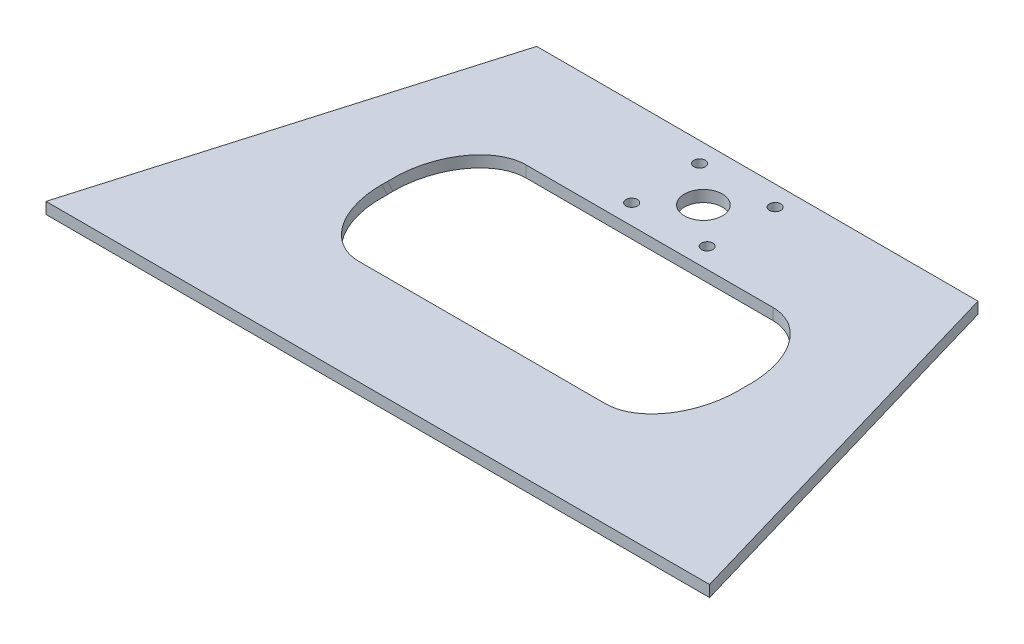
ISO-10303-21;
HEADER;
FILE_DESCRIPTION(('STEP AP214'),'2;1');
FILE_NAME('part.step','',(''),(''),'','','');
FILE_SCHEMA(('AUTOMOTIVE_DESIGN { 1 0 10303 214 1 1 1 1 }'));
ENDSEC;
DATA;
#1=APPLICATION_CONTEXT('core data for automotive mechanical design processes');
#2=APPLICATION_PROTOCOL_DEFINITION('international standard','automotive_design',2000,#1);
#3=PRODUCT_CONTEXT('',#1,'mechanical');
#4=PRODUCT('Part','Part','',(#3));
#5=PRODUCT_RELATED_PRODUCT_CATEGORY('part','',(#4));
#6=PRODUCT_DEFINITION_FORMATION('','',#4);
#7=PRODUCT_DEFINITION_CONTEXT('part definition',#1,'design');
#8=PRODUCT_DEFINITION('design','',#6,#7);
#9=PRODUCT_DEFINITION_SHAPE('','',#8);
#10=(LENGTH_UNIT() NAMED_UNIT(*) SI_UNIT(.MILLI.,.METRE.));
#11=(NAMED_UNIT(*) PLANE_ANGLE_UNIT() SI_UNIT($,.RADIAN.));
#12=(NAMED_UNIT(*) SI_UNIT($,.STERADIAN.) SOLID_ANGLE_UNIT());
#13=UNCERTAINTY_MEASURE_WITH_UNIT(LENGTH_MEASURE(1.E-05),#10,'distance_accuracy_value','');
#14=(GEOMETRIC_REPRESENTATION_CONTEXT(3) GLOBAL_UNCERTAINTY_ASSIGNED_CONTEXT((#13)) GLOBAL_UNIT_ASSIGNED_CONTEXT((#10,
#11,#12)) REPRESENTATION_CONTEXT('',''));
#15=CARTESIAN_POINT('',(0.,0.,0.));
#16=DIRECTION('',(0.,0.,1.));
#17=DIRECTION('',(1.,0.,0.));
#18=AXIS2_PLACEMENT_3D('',#15,#16,#17);
#19=CARTESIAN_POINT('',(54.8999999999994,-7.,-48.0395752908427));
#20=DIRECTION('',(0.,1.,0.));
#21=DIRECTION('',(0.,0.,1.));
#22=AXIS2_PLACEMENT_3D('',#19,#20,#21);
#23=ELLIPSE('',#22,20.5155954288015,14.5);
#24=DIRECTION('',(0.,1.,0.));
#25=VECTOR('',#24,1.);
#26=SURFACE_OF_LINEAR_EXTRUSION('',#23,#25);
#27=DIRECTION('',(0.,1.,0.));
#28=VECTOR('',#27,1.);
#29=CARTESIAN_POINT('',(54.8999999999994,1.5,-27.5239798620412));
#30=LINE('',#29,#28);
#31=CARTESIAN_POINT('',(54.8999999999994,0.,-27.5239798620412));
#32=VERTEX_POINT('',#31);
#33=CARTESIAN_POINT('',(54.8999999999994,3.,-27.5239798620412));
#34=VERTEX_POINT('',#33);
#35=EDGE_CURVE('E50',#32,#34,#30,.T.);
#36=ORIENTED_EDGE('',*,*,#35,.F.);
#37=CARTESIAN_POINT('',(54.8999999999994,0.,-48.0395752908427));
#38=DIRECTION('',(0.,1.,0.));
#39=DIRECTION('',(0.,0.,1.));
#40=AXIS2_PLACEMENT_3D('',#37,#38,#39);
#41=ELLIPSE('',#40,20.5155954288015,14.5);
#42=CARTESIAN_POINT('',(40.4388811468374,0.,-49.5409646205544));
#43=VERTEX_POINT('',#42);
#44=EDGE_CURVE('E155',#32,#43,#41,.F.);
#45=ORIENTED_EDGE('',*,*,#44,.T.);
#46=CARTESIAN_POINT('',(40.8380503622644,-7.,-53.0442063898716));
#47=CARTESIAN_POINT('',(40.764359717433,-6.17134305892181,-52.6294941618387));
#48=CARTESIAN_POINT('',(40.7002759410238,-5.34201217488286,-52.2144446477376));
#49=CARTESIAN_POINT('',(40.5908220425168,-3.6823369601079,-51.3838384260593));
#50=CARTESIAN_POINT('',(40.5454524806224,-2.85199259977995,-50.9682817036725));
#51=CARTESIAN_POINT('',(40.4729588721765,-1.19130659468812,-50.1371696213149));
#52=CARTESIAN_POINT('',(40.4458209683537,-0.360965428637962,-49.7216145009201));
#53=CARTESIAN_POINT('',(40.4094839537083,1.30000680492889,-48.8903591726677));
#54=CARTESIAN_POINT('',(40.4002840885266,2.1306378587854,-48.4746589716466));
#55=CARTESIAN_POINT('',(40.4000021612994,2.97416633493186,-48.0525040872018));
#56=CARTESIAN_POINT('',(40.4000000018857,2.98708317015572,-48.046039687676));
#57=CARTESIAN_POINT('',(40.3999999999994,2.99999999999998,-48.0395752908427));
#58=B_SPLINE_CURVE_WITH_KNOTS('',3,(#46,#47,#48,#49,#50,#51,#52,#53,#54,#55,#56,#57),
.UNSPECIFIED.,.F.,.F.,(4,2,2,2,2,4),(0.,2.78862709260098,5.57733765571683,8.36392620822776,
11.1503975721296,11.1937299828238),.UNSPECIFIED.);
#59=CARTESIAN_POINT('',(40.3999999999994,3.,-48.0395752908427));
#60=VERTEX_POINT('',#59);
#61=EDGE_CURVE('E146',#43,#60,#58,.T.);
#62=ORIENTED_EDGE('',*,*,#61,.T.);
#63=CARTESIAN_POINT('',(54.8999999999994,2.99999999999998,-48.0395752908427));
#64=DIRECTION('',(0.,-1.,0.));
#65=DIRECTION('',(0.,0.,1.));
#66=AXIS2_PLACEMENT_3D('',#63,#64,#65);
#67=ELLIPSE('',#66,20.5155954288015,14.5);
#68=EDGE_CURVE('E168',#34,#60,#67,.T.);
#69=ORIENTED_EDGE('',*,*,#68,.F.);
#70=EDGE_LOOP('',(#36,#45,#62,#69));
#71=FACE_BOUND('',#70,.T.);
#72=ADVANCED_FACE('F42',(#71),#26,.F.);
#73=CARTESIAN_POINT('',(119.9,-40.2845577931788,-91.3642240987341));
#74=DIRECTION('',(0.,0.706779388895714,0.707434021964028));
#75=DIRECTION('',(-1.,0.,0.));
#76=AXIS2_PLACEMENT_3D('',#73,#74,#75);
#77=CYLINDRICAL_SURFACE('',#76,14.5);
#78=CARTESIAN_POINT('',(134.327032886282,4.10732985603376,-48.9867868771124));
#79=CARTESIAN_POINT('',(134.367642751696,2.96618665467746,-49.5578869547174));
#80=CARTESIAN_POINT('',(134.391257266257,1.82462857676761,-50.1291946586805));
#81=CARTESIAN_POINT('',(134.399253217156,0.468254060296802,-50.8080100669501));
#82=CARTESIAN_POINT('',(134.399921728441,0.25350231158661,-50.9154853949498));
#83=CARTESIAN_POINT('',(134.39999783978,0.0258336700292439,-51.0294251514074));
#84=CARTESIAN_POINT('',(134.399999999198,0.0129168348674314,-51.0358895509072));
#85=CARTESIAN_POINT('',(134.4,0.,-51.0423539502601));
#86=B_SPLINE_CURVE_WITH_KNOTS('',3,(#78,#79,#80,#81,#82,#83,#84,#85),.UNSPECIFIED.,.F.,.F.,(4,2,
2,4),(0.,3.8298801230995,4.55031307091073,4.59364548160489),.UNSPECIFIED.);
#87=CARTESIAN_POINT('',(134.4,0.,-51.0423539502601));
#88=VERTEX_POINT('',#87);
#89=CARTESIAN_POINT('',(134.361118853162,2.99999999999998,-49.5409646205496));
#90=VERTEX_POINT('',#89);
#91=EDGE_CURVE('E184',#88,#90,#86,.F.);
#92=ORIENTED_EDGE('',*,*,#91,.F.);
#93=CARTESIAN_POINT('',(119.9,0.,-51.04235395026));
#94=DIRECTION('',(0.,-1.,0.));
#95=DIRECTION('',(0.,0.,1.));
#96=AXIS2_PLACEMENT_3D('',#93,#94,#95);
#97=ELLIPSE('',#96,20.5155954288015,14.5);
#98=CARTESIAN_POINT('',(134.361118853162,0.,-49.5409646205496));
#99=VERTEX_POINT('',#98);
#100=EDGE_CURVE('E137',#99,#88,#97,.F.);
#101=ORIENTED_EDGE('',*,*,#100,.F.);
#102=CARTESIAN_POINT('',(133.961949637735,-7.,-53.0442063898716));
#103=CARTESIAN_POINT('',(134.035640282566,-6.17134305892782,-52.6294941618267));
#104=CARTESIAN_POINT('',(134.099724058975,-5.34201217488587,-52.2144446477316));
#105=CARTESIAN_POINT('',(134.209177957482,-3.68233696010491,-51.3838384260653));
#106=CARTESIAN_POINT('',(134.254547519377,-2.85199259977397,-50.9682817036845));
#107=CARTESIAN_POINT('',(134.327041127822,-1.19130659469413,-50.137169621303));
#108=CARTESIAN_POINT('',(134.354179031645,-0.360965428658924,-49.7216145008783));
#109=CARTESIAN_POINT('',(134.390516046291,1.30000680494967,-48.8903591727093));
#110=CARTESIAN_POINT('',(134.399715911472,2.13063785886287,-48.4746589718015));
#111=CARTESIAN_POINT('',(134.3999978387,2.97416633493425,-48.0525040872066));
#112=CARTESIAN_POINT('',(134.399999998113,2.98708317015694,-48.0460396876785));
#113=CARTESIAN_POINT('',(134.4,2.99999999999998,-48.0395752908427));
#114=B_SPLINE_CURVE_WITH_KNOTS('',3,(#102,#103,#104,#105,#106,#107,#108,#109,#110,#111,#112,
#113),.UNSPECIFIED.,.F.,.F.,(4,2,2,2,2,4),(0.,2.78862709260098,5.57733765571676,
8.36392620822771,11.1503975721296,11.1937299828238),.UNSPECIFIED.);
#115=CARTESIAN_POINT('',(134.4,3.,-48.0395752908427));
#116=VERTEX_POINT('',#115);
#117=EDGE_CURVE('E186',#116,#99,#114,.F.);
#118=ORIENTED_EDGE('',*,*,#117,.F.);
#119=CARTESIAN_POINT('',(119.9,2.99999999999998,-48.0395752908427));
#120=DIRECTION('',(0.,-1.,0.));
#121=DIRECTION('',(0.,0.,1.));
#122=AXIS2_PLACEMENT_3D('',#119,#120,#121);
#123=ELLIPSE('',#122,20.5155954288015,14.5);
#124=EDGE_CURVE('E149',#90,#116,#123,.T.);
#125=ORIENTED_EDGE('',*,*,#124,.F.);
#126=EDGE_LOOP('',(#92,#101,#118,#125));
#127=FACE_BOUND('',#126,.T.);
#128=ADVANCED_FACE('F207',(#127),#77,.F.);
#129=CARTESIAN_POINT('',(54.8999999999994,-40.2845577931788,-91.3642240987341));
#130=DIRECTION('',(0.,0.706779388895714,0.707434021964028));
#131=DIRECTION('',(-1.,0.,0.));
#132=AXIS2_PLACEMENT_3D('',#129,#130,#131);
#133=CYLINDRICAL_SURFACE('',#132,14.5);
#134=CARTESIAN_POINT('',(40.4729671137166,4.10732985603375,-48.9867868771124));
#135=CARTESIAN_POINT('',(40.4323572483054,2.96618665367044,-49.5578869527071));
#136=CARTESIAN_POINT('',(40.4087427337427,1.82462857659892,-50.1291946583471));
#137=CARTESIAN_POINT('',(40.400746782843,0.468254060326865,-50.8080100670137));
#138=CARTESIAN_POINT('',(40.4000782715583,0.253502311625161,-50.9154853950284));
#139=CARTESIAN_POINT('',(40.4000021602187,0.0258336700337782,-51.029425151416));
#140=CARTESIAN_POINT('',(40.4000000008007,0.0129168348698428,-51.0358895509116));
#141=CARTESIAN_POINT('',(40.3999999999994,0.,-51.04235395026));
#142=B_SPLINE_CURVE_WITH_KNOTS('',3,(#134,#135,#136,#137,#138,#139,#140,#141),.UNSPECIFIED.,.F.,
.F.,(4,2,2,4),(0.,3.829880123102,4.55031307091054,4.59364548160471),.UNSPECIFIED.);
#143=CARTESIAN_POINT('',(40.4388811468374,2.99999999999998,-49.5409646205514));
#144=VERTEX_POINT('',#143);
#145=CARTESIAN_POINT('',(40.3999999999994,0.,-51.04235395026));
#146=VERTEX_POINT('',#145);
#147=EDGE_CURVE('E64',#144,#146,#142,.T.);
#148=ORIENTED_EDGE('',*,*,#147,.F.);
#149=EDGE_CURVE('E173',#60,#144,#67,.T.);
#150=ORIENTED_EDGE('',*,*,#149,.F.);
#151=ORIENTED_EDGE('',*,*,#61,.F.);
#152=CARTESIAN_POINT('',(54.8999999999994,0.,-51.04235395026));
#153=DIRECTION('',(0.,-1.,0.));
#154=DIRECTION('',(0.,0.,1.));
#155=AXIS2_PLACEMENT_3D('',#152,#153,#154);
#156=ELLIPSE('',#155,20.5155954288015,14.5);
#157=EDGE_CURVE('E138',#146,#43,#156,.F.);
#158=ORIENTED_EDGE('',*,*,#157,.F.);
#159=EDGE_LOOP('',(#148,#150,#151,#158));
#160=FACE_BOUND('',#159,.T.);
#161=ADVANCED_FACE('F211',(#160),#133,.F.);
#162=CARTESIAN_POINT('',(0.,3.,0.));
#163=DIRECTION('',(0.,-1.,0.));
#164=DIRECTION('',(0.,0.,-1.));
#165=AXIS2_PLACEMENT_3D('',#162,#163,#164);
#166=PLANE('',#165);
#167=CARTESIAN_POINT('',(87.3999999999996,3.,-85.7789746895304));
#168=DIRECTION('',(0.,-1.,0.));
#169=DIRECTION('',(0.,0.,-1.));
#170=AXIS2_PLACEMENT_3D('',#167,#168,#169);
#171=CIRCLE('',#170,5.);
#172=CARTESIAN_POINT('',(87.3999999999996,3.,-90.7789746895304));
#173=VERTEX_POINT('',#172);
#174=EDGE_CURVE('E269',#173,#173,#171,.T.);
#175=ORIENTED_EDGE('',*,*,#174,.T.);
#176=EDGE_LOOP('',(#175));
#177=FACE_BOUND('',#176,.T.);
#178=CARTESIAN_POINT('',(97.3499999999996,3.,-76.8289746895307));
#179=DIRECTION('',(0.,-1.,0.));
#180=DIRECTION('',(0.,0.,-1.));
#181=AXIS2_PLACEMENT_3D('',#178,#179,#180);
#182=CIRCLE('',#181,1.49999999999999);
#183=CARTESIAN_POINT('',(97.3499999999996,3.,-78.3289746895307));
#184=VERTEX_POINT('',#183);
#185=EDGE_CURVE('E263',#184,#184,#182,.T.);
#186=ORIENTED_EDGE('',*,*,#185,.T.);
#187=EDGE_LOOP('',(#186));
#188=FACE_BOUND('',#187,.T.);
#189=CARTESIAN_POINT('',(97.3499999999996,3.,-94.7289746895306));
#190=DIRECTION('',(0.,-1.,0.));
#191=DIRECTION('',(0.,0.,-1.));
#192=AXIS2_PLACEMENT_3D('',#189,#190,#191);
#193=CIRCLE('',#192,1.49999999999999);
#194=CARTESIAN_POINT('',(97.3499999999996,3.,-96.2289746895306));
#195=VERTEX_POINT('',#194);
#196=EDGE_CURVE('E257',#195,#195,#193,.T.);
#197=ORIENTED_EDGE('',*,*,#196,.T.);
#198=EDGE_LOOP('',(#197));
#199=FACE_BOUND('',#198,.T.);
#200=CARTESIAN_POINT('',(77.4499999999996,3.,-94.7289746895306));
#201=DIRECTION('',(0.,-1.,0.));
#202=DIRECTION('',(0.,0.,-1.));
#203=AXIS2_PLACEMENT_3D('',#200,#201,#202);
#204=CIRCLE('',#203,1.49999999999999);
#205=CARTESIAN_POINT('',(77.4499999999996,3.,-96.2289746895306));
#206=VERTEX_POINT('',#205);
#207=EDGE_CURVE('E251',#206,#206,#204,.T.);
#208=ORIENTED_EDGE('',*,*,#207,.T.);
#209=EDGE_LOOP('',(#208));
#210=FACE_BOUND('',#209,.T.);
#211=CARTESIAN_POINT('',(77.4499999999996,3.,-76.8289746895307));
#212=DIRECTION('',(0.,-1.,0.));
#213=DIRECTION('',(0.,0.,-1.));
#214=AXIS2_PLACEMENT_3D('',#211,#212,#213);
#215=CIRCLE('',#214,1.49999999999999);
#216=CARTESIAN_POINT('',(77.4499999999996,3.,-78.3289746895307));
#217=VERTEX_POINT('',#216);
#218=EDGE_CURVE('E245',#217,#217,#215,.T.);
#219=ORIENTED_EDGE('',*,*,#218,.T.);
#220=EDGE_LOOP('',(#219));
#221=FACE_BOUND('',#220,.T.);
#222=CARTESIAN_POINT('',(54.8999999999994,3.,-51.04235395026));
#223=DIRECTION('',(0.,-1.,0.));
#224=DIRECTION('',(0.,0.,-1.));
#225=AXIS2_PLACEMENT_3D('',#222,#223,#224);
#226=ELLIPSE('',#225,20.5155954288015,14.5);
#227=CARTESIAN_POINT('',(54.8999999999995,3.,-71.5579493790615));
#228=VERTEX_POINT('',#227);
#229=EDGE_CURVE('E239',#144,#228,#226,.T.);
#230=ORIENTED_EDGE('',*,*,#229,.T.);
#231=DIRECTION('',(1.,0.,0.));
#232=VECTOR('',#231,1.);
#233=CARTESIAN_POINT('',(0.,3.,-71.5579493790615));
#234=LINE('',#233,#232);
#235=CARTESIAN_POINT('',(119.9,3.00000000000001,-71.5579493790615));
#236=VERTEX_POINT('',#235);
#237=EDGE_CURVE('E57',#228,#236,#234,.T.);
#238=ORIENTED_EDGE('',*,*,#237,.T.);
#239=CARTESIAN_POINT('',(119.9,3.,-51.04235395026));
#240=DIRECTION('',(0.,-1.,0.));
#241=DIRECTION('',(0.,0.,-1.));
#242=AXIS2_PLACEMENT_3D('',#239,#240,#241);
#243=ELLIPSE('',#242,20.5155954288015,14.5);
#244=EDGE_CURVE('E189',#236,#90,#243,.T.);
#245=ORIENTED_EDGE('',*,*,#244,.T.);
#246=ORIENTED_EDGE('',*,*,#124,.T.);
#247=CARTESIAN_POINT('',(119.9,3.,-48.0395752908427));
#248=DIRECTION('',(0.,1.,0.));
#249=DIRECTION('',(0.,0.,-1.));
#250=AXIS2_PLACEMENT_3D('',#247,#248,#249);
#251=ELLIPSE('',#250,20.5155954288014,14.5);
#252=CARTESIAN_POINT('',(119.9,3.,-27.5239798620413));
#253=VERTEX_POINT('',#252);
#254=EDGE_CURVE('E179',#253,#116,#251,.T.);
#255=ORIENTED_EDGE('',*,*,#254,.F.);
#256=DIRECTION('',(-1.,0.,0.));
#257=VECTOR('',#256,1.);
#258=CARTESIAN_POINT('',(87.3999999999995,2.99999999999998,-27.5239798620412));
#259=LINE('',#258,#257);
#260=EDGE_CURVE('E145',#253,#34,#259,.T.);
#261=ORIENTED_EDGE('',*,*,#260,.T.);
#262=ORIENTED_EDGE('',*,*,#68,.T.);
#263=ORIENTED_EDGE('',*,*,#149,.T.);
#264=EDGE_LOOP('',(#230,#238,#245,#246,#255,#261,#262,#263));
#265=FACE_BOUND('',#264,.T.);
#266=DIRECTION('',(-0.281001727065247,0.,0.959707262339068));
#267=VECTOR('',#266,1.);
#268=CARTESIAN_POINT('',(0.,3.,0.));
#269=LINE('',#268,#267);
#270=CARTESIAN_POINT('',(29.2799417168491,3.,-100.));
#271=VERTEX_POINT('',#270);
#272=CARTESIAN_POINT('',(0.,3.,0.));
#273=VERTEX_POINT('',#272);
#274=EDGE_CURVE('E333',#271,#273,#269,.T.);
#275=ORIENTED_EDGE('',*,*,#274,.T.);
#276=DIRECTION('',(1.,0.,0.));
#277=VECTOR('',#276,1.);
#278=CARTESIAN_POINT('',(0.,3.,0.));
#279=LINE('',#278,#277);
#280=CARTESIAN_POINT('',(174.8,3.,0.));
#281=VERTEX_POINT('',#280);
#282=EDGE_CURVE('E342',#273,#281,#279,.T.);
#283=ORIENTED_EDGE('',*,*,#282,.T.);
#284=DIRECTION('',(-0.281001727065255,0.,-0.959707262339066));
#285=VECTOR('',#284,1.);
#286=CARTESIAN_POINT('',(174.8,3.,0.));
#287=LINE('',#286,#285);
#288=CARTESIAN_POINT('',(145.52005828315,3.,-100.));
#289=VERTEX_POINT('',#288);
#290=EDGE_CURVE('E340',#281,#289,#287,.T.);
#291=ORIENTED_EDGE('',*,*,#290,.T.);
#292=DIRECTION('',(-1.,0.,0.));
#293=VECTOR('',#292,1.);
#294=CARTESIAN_POINT('',(29.2799417168491,3.,-100.));
#295=LINE('',#294,#293);
#296=EDGE_CURVE('E329',#289,#271,#295,.T.);
#297=ORIENTED_EDGE('',*,*,#296,.T.);
#298=EDGE_LOOP('',(#275,#283,#291,#297));
#299=FACE_BOUND('',#298,.T.);
#300=ADVANCED_FACE('F176',(#177,#188,#199,#210,#221,#265,#299),#166,.F.);
#301=CARTESIAN_POINT('',(0.,3.,0.));
#302=DIRECTION('',(0.,0.,-1.));
#303=DIRECTION('',(-1.,0.,0.));
#304=AXIS2_PLACEMENT_3D('',#301,#302,#303);
#305=PLANE('',#304);
#306=DIRECTION('',(1.,0.,0.));
#307=VECTOR('',#306,1.);
#308=CARTESIAN_POINT('',(0.,0.,0.));
#309=LINE('',#308,#307);
#310=CARTESIAN_POINT('',(0.,0.,0.));
#311=VERTEX_POINT('',#310);
#312=CARTESIAN_POINT('',(174.8,0.,0.));
#313=VERTEX_POINT('',#312);
#314=EDGE_CURVE('E335',#311,#313,#309,.T.);
#315=ORIENTED_EDGE('',*,*,#314,.T.);
#316=DIRECTION('',(0.,-1.,0.));
#317=VECTOR('',#316,1.);
#318=CARTESIAN_POINT('',(174.8,3.,0.));
#319=LINE('',#318,#317);
#320=EDGE_CURVE('E320',#281,#313,#319,.T.);
#321=ORIENTED_EDGE('',*,*,#320,.F.);
#322=ORIENTED_EDGE('',*,*,#282,.F.);
#323=DIRECTION('',(0.,-1.,0.));
#324=VECTOR('',#323,1.);
#325=CARTESIAN_POINT('',(0.,3.,0.));
#326=LINE('',#325,#324);
#327=EDGE_CURVE('E317',#273,#311,#326,.T.);
#328=ORIENTED_EDGE('',*,*,#327,.T.);
#329=EDGE_LOOP('',(#315,#321,#322,#328));
#330=FACE_BOUND('',#329,.T.);
#331=ADVANCED_FACE('F352',(#330),#305,.F.);
#332=CARTESIAN_POINT('',(174.8,3.,0.));
#333=DIRECTION('',(-0.959707262339066,0.,0.281001727065255));
#334=DIRECTION('',(0.281001727065255,0.,0.959707262339066));
#335=AXIS2_PLACEMENT_3D('',#332,#333,#334);
#336=PLANE('',#335);
#337=DIRECTION('',(-0.281001727065255,0.,-0.959707262339066));
#338=VECTOR('',#337,1.);
#339=CARTESIAN_POINT('',(174.8,0.,0.));
#340=LINE('',#339,#338);
#341=CARTESIAN_POINT('',(145.52005828315,0.,-100.));
#342=VERTEX_POINT('',#341);
#343=EDGE_CURVE('E332',#313,#342,#340,.T.);
#344=ORIENTED_EDGE('',*,*,#343,.T.);
#345=DIRECTION('',(0.,-1.,0.));
#346=VECTOR('',#345,1.);
#347=CARTESIAN_POINT('',(145.52005828315,3.,-100.));
#348=LINE('',#347,#346);
#349=EDGE_CURVE('E323',#289,#342,#348,.T.);
#350=ORIENTED_EDGE('',*,*,#349,.F.);
#351=ORIENTED_EDGE('',*,*,#290,.F.);
#352=ORIENTED_EDGE('',*,*,#320,.T.);
#353=EDGE_LOOP('',(#344,#350,#351,#352));
#354=FACE_BOUND('',#353,.T.);
#355=ADVANCED_FACE('F357',(#354),#336,.F.);
#356=CARTESIAN_POINT('',(29.2799417168491,3.,-100.));
#357=DIRECTION('',(0.,0.,1.));
#358=DIRECTION('',(1.,0.,0.));
#359=AXIS2_PLACEMENT_3D('',#356,#357,#358);
#360=PLANE('',#359);
#361=DIRECTION('',(-1.,0.,0.));
#362=VECTOR('',#361,1.);
#363=CARTESIAN_POINT('',(29.2799417168491,0.,-100.));
#364=LINE('',#363,#362);
#365=CARTESIAN_POINT('',(29.2799417168491,0.,-100.));
#366=VERTEX_POINT('',#365);
#367=EDGE_CURVE('E330',#342,#366,#364,.T.);
#368=ORIENTED_EDGE('',*,*,#367,.T.);
#369=DIRECTION('',(0.,-1.,0.));
#370=VECTOR('',#369,1.);
#371=CARTESIAN_POINT('',(29.2799417168491,3.,-100.));
#372=LINE('',#371,#370);
#373=EDGE_CURVE('E326',#271,#366,#372,.T.);
#374=ORIENTED_EDGE('',*,*,#373,.F.);
#375=ORIENTED_EDGE('',*,*,#296,.F.);
#376=ORIENTED_EDGE('',*,*,#349,.T.);
#377=EDGE_LOOP('',(#368,#374,#375,#376));
#378=FACE_BOUND('',#377,.T.);
#379=ADVANCED_FACE('F461',(#378),#360,.F.);
#380=CARTESIAN_POINT('',(0.,3.,0.));
#381=DIRECTION('',(0.959707262339068,0.,0.281001727065248));
#382=DIRECTION('',(0.281001727065248,0.,-0.959707262339068));
#383=AXIS2_PLACEMENT_3D('',#380,#381,#382);
#384=PLANE('',#383);
#385=DIRECTION('',(-0.281001727065247,0.,0.959707262339068));
#386=VECTOR('',#385,1.);
#387=CARTESIAN_POINT('',(0.,0.,0.));
#388=LINE('',#387,#386);
#389=EDGE_CURVE('E157',#366,#311,#388,.T.);
#390=ORIENTED_EDGE('',*,*,#389,.T.);
#391=ORIENTED_EDGE('',*,*,#327,.F.);
#392=ORIENTED_EDGE('',*,*,#274,.F.);
#393=ORIENTED_EDGE('',*,*,#373,.T.);
#394=EDGE_LOOP('',(#390,#391,#392,#393));
#395=FACE_BOUND('',#394,.T.);
#396=ADVANCED_FACE('F280',(#395),#384,.F.);
#397=CARTESIAN_POINT('',(0.,0.,0.));
#398=DIRECTION('',(0.,-1.,0.));
#399=DIRECTION('',(0.,0.,-1.));
#400=AXIS2_PLACEMENT_3D('',#397,#398,#399);
#401=PLANE('',#400);
#402=CARTESIAN_POINT('',(87.3999999999996,0.,-85.7789746895304));
#403=DIRECTION('',(0.,-1.,0.));
#404=DIRECTION('',(0.,0.,-1.));
#405=AXIS2_PLACEMENT_3D('',#402,#403,#404);
#406=CIRCLE('',#405,5.);
#407=CARTESIAN_POINT('',(87.3999999999996,0.,-90.7789746895304));
#408=VERTEX_POINT('',#407);
#409=EDGE_CURVE('E272',#408,#408,#406,.T.);
#410=ORIENTED_EDGE('',*,*,#409,.F.);
#411=EDGE_LOOP('',(#410));
#412=FACE_BOUND('',#411,.T.);
#413=CARTESIAN_POINT('',(97.3499999999996,0.,-76.8289746895307));
#414=DIRECTION('',(0.,-1.,0.));
#415=DIRECTION('',(0.,0.,-1.));
#416=AXIS2_PLACEMENT_3D('',#413,#414,#415);
#417=CIRCLE('',#416,1.49999999999999);
#418=CARTESIAN_POINT('',(97.3499999999996,0.,-78.3289746895306));
#419=VERTEX_POINT('',#418);
#420=EDGE_CURVE('E266',#419,#419,#417,.T.);
#421=ORIENTED_EDGE('',*,*,#420,.F.);
#422=EDGE_LOOP('',(#421));
#423=FACE_BOUND('',#422,.T.);
#424=CARTESIAN_POINT('',(97.3499999999996,0.,-94.7289746895306));
#425=DIRECTION('',(0.,-1.,0.));
#426=DIRECTION('',(0.,0.,-1.));
#427=AXIS2_PLACEMENT_3D('',#424,#425,#426);
#428=CIRCLE('',#427,1.49999999999999);
#429=CARTESIAN_POINT('',(97.3499999999996,0.,-96.2289746895305));
#430=VERTEX_POINT('',#429);
#431=EDGE_CURVE('E260',#430,#430,#428,.T.);
#432=ORIENTED_EDGE('',*,*,#431,.F.);
#433=EDGE_LOOP('',(#432));
#434=FACE_BOUND('',#433,.T.);
#435=CARTESIAN_POINT('',(77.4499999999996,0.,-94.7289746895306));
#436=DIRECTION('',(0.,-1.,0.));
#437=DIRECTION('',(0.,0.,-1.));
#438=AXIS2_PLACEMENT_3D('',#435,#436,#437);
#439=CIRCLE('',#438,1.49999999999999);
#440=CARTESIAN_POINT('',(77.4499999999996,0.,-96.2289746895306));
#441=VERTEX_POINT('',#440);
#442=EDGE_CURVE('E254',#441,#441,#439,.T.);
#443=ORIENTED_EDGE('',*,*,#442,.F.);
#444=EDGE_LOOP('',(#443));
#445=FACE_BOUND('',#444,.T.);
#446=CARTESIAN_POINT('',(77.4499999999996,0.,-76.8289746895307));
#447=DIRECTION('',(0.,-1.,0.));
#448=DIRECTION('',(0.,0.,-1.));
#449=AXIS2_PLACEMENT_3D('',#446,#447,#448);
#450=CIRCLE('',#449,1.49999999999999);
#451=CARTESIAN_POINT('',(77.4499999999996,0.,-78.3289746895307));
#452=VERTEX_POINT('',#451);
#453=EDGE_CURVE('E248',#452,#452,#450,.T.);
#454=ORIENTED_EDGE('',*,*,#453,.F.);
#455=EDGE_LOOP('',(#454));
#456=FACE_BOUND('',#455,.T.);
#457=CARTESIAN_POINT('',(119.9,0.,-48.0395752908427));
#458=DIRECTION('',(0.,1.,0.));
#459=DIRECTION('',(0.,0.,-1.));
#460=AXIS2_PLACEMENT_3D('',#457,#458,#459);
#461=ELLIPSE('',#460,20.5155954288014,14.5);
#462=CARTESIAN_POINT('',(119.9,0.,-27.5239798620412));
#463=VERTEX_POINT('',#462);
#464=EDGE_CURVE('E183',#99,#463,#461,.F.);
#465=ORIENTED_EDGE('',*,*,#464,.F.);
#466=ORIENTED_EDGE('',*,*,#100,.T.);
#467=CARTESIAN_POINT('',(119.9,0.,-51.04235395026));
#468=DIRECTION('',(0.,-1.,0.));
#469=DIRECTION('',(0.,0.,-1.));
#470=AXIS2_PLACEMENT_3D('',#467,#468,#469);
#471=ELLIPSE('',#470,20.5155954288015,14.5);
#472=CARTESIAN_POINT('',(119.9,0.,-71.5579493790615));
#473=VERTEX_POINT('',#472);
#474=EDGE_CURVE('E144',#473,#88,#471,.T.);
#475=ORIENTED_EDGE('',*,*,#474,.F.);
#476=DIRECTION('',(1.,0.,0.));
#477=VECTOR('',#476,1.);
#478=CARTESIAN_POINT('',(0.,0.,-71.5579493790615));
#479=LINE('',#478,#477);
#480=CARTESIAN_POINT('',(54.8999999999995,0.,-71.5579493790615));
#481=VERTEX_POINT('',#480);
#482=EDGE_CURVE('E130',#481,#473,#479,.T.);
#483=ORIENTED_EDGE('',*,*,#482,.F.);
#484=EDGE_CURVE('E134',#481,#146,#156,.F.);
#485=ORIENTED_EDGE('',*,*,#484,.T.);
#486=ORIENTED_EDGE('',*,*,#157,.T.);
#487=ORIENTED_EDGE('',*,*,#44,.F.);
#488=DIRECTION('',(-1.,0.,0.));
#489=VECTOR('',#488,1.);
#490=CARTESIAN_POINT('',(0.,0.,-27.5239798620412));
#491=LINE('',#490,#489);
#492=EDGE_CURVE('E151',#463,#32,#491,.T.);
#493=ORIENTED_EDGE('',*,*,#492,.F.);
#494=EDGE_LOOP('',(#465,#466,#475,#483,#485,#486,#487,#493));
#495=FACE_BOUND('',#494,.T.);
#496=ORIENTED_EDGE('',*,*,#389,.F.);
#497=ORIENTED_EDGE('',*,*,#367,.F.);
#498=ORIENTED_EDGE('',*,*,#343,.F.);
#499=ORIENTED_EDGE('',*,*,#314,.F.);
#500=EDGE_LOOP('',(#496,#497,#498,#499));
#501=FACE_BOUND('',#500,.T.);
#502=ADVANCED_FACE('F44',(#412,#423,#434,#445,#456,#495,#501),#401,.T.);
#503=CARTESIAN_POINT('',(54.8999999999994,-7.,-27.5239798620412));
#504=DIRECTION('',(0.,0.,1.));
#505=DIRECTION('',(1.,0.,0.));
#506=AXIS2_PLACEMENT_3D('',#503,#504,#505);
#507=PLANE('',#506);
#508=ORIENTED_EDGE('',*,*,#492,.T.);
#509=ORIENTED_EDGE('',*,*,#35,.T.);
#510=ORIENTED_EDGE('',*,*,#260,.F.);
#511=DIRECTION('',(0.,1.,0.));
#512=VECTOR('',#511,1.);
#513=CARTESIAN_POINT('',(119.9,-6.99999999999999,-27.5239798620412));
#514=LINE('',#513,#512);
#515=EDGE_CURVE('E201',#463,#253,#514,.T.);
#516=ORIENTED_EDGE('',*,*,#515,.F.);
#517=EDGE_LOOP('',(#508,#509,#510,#516));
#518=FACE_BOUND('',#517,.T.);
#519=ADVANCED_FACE('F162',(#518),#507,.F.);
#520=CARTESIAN_POINT('',(119.9,-7.,-48.0395752908427));
#521=DIRECTION('',(0.,1.,0.));
#522=DIRECTION('',(0.,0.,-1.));
#523=AXIS2_PLACEMENT_3D('',#520,#521,#522);
#524=ELLIPSE('',#523,20.5155954288014,14.5);
#525=DIRECTION('',(0.,1.,0.));
#526=VECTOR('',#525,1.);
#527=SURFACE_OF_LINEAR_EXTRUSION('',#524,#526);
#528=ORIENTED_EDGE('',*,*,#117,.T.);
#529=ORIENTED_EDGE('',*,*,#464,.T.);
#530=ORIENTED_EDGE('',*,*,#515,.T.);
#531=ORIENTED_EDGE('',*,*,#254,.T.);
#532=EDGE_LOOP('',(#528,#529,#530,#531));
#533=FACE_BOUND('',#532,.T.);
#534=ADVANCED_FACE('F203',(#533),#527,.F.);
#535=CARTESIAN_POINT('',(119.9,10.,-51.04235395026));
#536=DIRECTION('',(0.,-1.,0.));
#537=DIRECTION('',(0.,0.,-1.));
#538=AXIS2_PLACEMENT_3D('',#535,#536,#537);
#539=ELLIPSE('',#538,20.5155954288015,14.5);
#540=DIRECTION('',(0.,-1.,0.));
#541=VECTOR('',#540,1.);
#542=SURFACE_OF_LINEAR_EXTRUSION('',#539,#541);
#543=ORIENTED_EDGE('',*,*,#244,.F.);
#544=DIRECTION('',(0.,-1.,0.));
#545=VECTOR('',#544,1.);
#546=CARTESIAN_POINT('',(119.9,10.,-71.5579493790615));
#547=LINE('',#546,#545);
#548=EDGE_CURVE('E240',#236,#473,#547,.T.);
#549=ORIENTED_EDGE('',*,*,#548,.T.);
#550=ORIENTED_EDGE('',*,*,#474,.T.);
#551=ORIENTED_EDGE('',*,*,#91,.T.);
#552=EDGE_LOOP('',(#543,#549,#550,#551));
#553=FACE_BOUND('',#552,.T.);
#554=ADVANCED_FACE('F222',(#553),#542,.F.);
#555=CARTESIAN_POINT('',(54.8999999999994,10.,-51.04235395026));
#556=DIRECTION('',(0.,-1.,0.));
#557=DIRECTION('',(0.,0.,-1.));
#558=AXIS2_PLACEMENT_3D('',#555,#556,#557);
#559=ELLIPSE('',#558,20.5155954288015,14.5);
#560=DIRECTION('',(0.,-1.,0.));
#561=VECTOR('',#560,1.);
#562=SURFACE_OF_LINEAR_EXTRUSION('',#559,#561);
#563=ORIENTED_EDGE('',*,*,#484,.F.);
#564=DIRECTION('',(0.,-1.,0.));
#565=VECTOR('',#564,1.);
#566=CARTESIAN_POINT('',(54.8999999999995,1.5,-71.5579493790615));
#567=LINE('',#566,#565);
#568=EDGE_CURVE('E11',#481,#228,#567,.F.);
#569=ORIENTED_EDGE('',*,*,#568,.T.);
#570=ORIENTED_EDGE('',*,*,#229,.F.);
#571=ORIENTED_EDGE('',*,*,#147,.T.);
#572=EDGE_LOOP('',(#563,#569,#570,#571));
#573=FACE_BOUND('',#572,.T.);
#574=ADVANCED_FACE('F135',(#573),#562,.F.);
#575=CARTESIAN_POINT('',(119.9,10.,-71.5579493790615));
#576=DIRECTION('',(0.,0.,-1.));
#577=DIRECTION('',(-1.,0.,0.));
#578=AXIS2_PLACEMENT_3D('',#575,#576,#577);
#579=PLANE('',#578);
#580=ORIENTED_EDGE('',*,*,#568,.F.);
#581=ORIENTED_EDGE('',*,*,#482,.T.);
#582=ORIENTED_EDGE('',*,*,#548,.F.);
#583=ORIENTED_EDGE('',*,*,#237,.F.);
#584=EDGE_LOOP('',(#580,#581,#582,#583));
#585=FACE_BOUND('',#584,.T.);
#586=ADVANCED_FACE('F128',(#585),#579,.F.);
#587=CARTESIAN_POINT('',(77.4499999999996,0.,-76.8289746895307));
#588=DIRECTION('',(0.,-1.,0.));
#589=DIRECTION('',(0.,0.,-1.));
#590=AXIS2_PLACEMENT_3D('',#587,#588,#589);
#591=CYLINDRICAL_SURFACE('',#590,1.49999999999999);
#592=ORIENTED_EDGE('',*,*,#218,.F.);
#593=EDGE_LOOP('',(#592));
#594=FACE_BOUND('',#593,.T.);
#595=ORIENTED_EDGE('',*,*,#453,.T.);
#596=EDGE_LOOP('',(#595));
#597=FACE_BOUND('',#596,.T.);
#598=ADVANCED_FACE('F289',(#594,#597),#591,.F.);
#599=CARTESIAN_POINT('',(77.4499999999996,0.,-94.7289746895306));
#600=DIRECTION('',(0.,-1.,0.));
#601=DIRECTION('',(0.,0.,-1.));
#602=AXIS2_PLACEMENT_3D('',#599,#600,#601);
#603=CYLINDRICAL_SURFACE('',#602,1.49999999999999);
#604=ORIENTED_EDGE('',*,*,#207,.F.);
#605=EDGE_LOOP('',(#604));
#606=FACE_BOUND('',#605,.T.);
#607=ORIENTED_EDGE('',*,*,#442,.T.);
#608=EDGE_LOOP('',(#607));
#609=FACE_BOUND('',#608,.T.);
#610=ADVANCED_FACE('F291',(#606,#609),#603,.F.);
#611=CARTESIAN_POINT('',(97.3499999999996,0.,-94.7289746895306));
#612=DIRECTION('',(0.,-1.,0.));
#613=DIRECTION('',(0.,0.,-1.));
#614=AXIS2_PLACEMENT_3D('',#611,#612,#613);
#615=CYLINDRICAL_SURFACE('',#614,1.49999999999999);
#616=ORIENTED_EDGE('',*,*,#196,.F.);
#617=EDGE_LOOP('',(#616));
#618=FACE_BOUND('',#617,.T.);
#619=ORIENTED_EDGE('',*,*,#431,.T.);
#620=EDGE_LOOP('',(#619));
#621=FACE_BOUND('',#620,.T.);
#622=ADVANCED_FACE('F298',(#618,#621),#615,.F.);
#623=CARTESIAN_POINT('',(97.3499999999996,0.,-76.8289746895307));
#624=DIRECTION('',(0.,-1.,0.));
#625=DIRECTION('',(0.,0.,-1.));
#626=AXIS2_PLACEMENT_3D('',#623,#624,#625);
#627=CYLINDRICAL_SURFACE('',#626,1.49999999999999);
#628=ORIENTED_EDGE('',*,*,#185,.F.);
#629=EDGE_LOOP('',(#628));
#630=FACE_BOUND('',#629,.T.);
#631=ORIENTED_EDGE('',*,*,#420,.T.);
#632=EDGE_LOOP('',(#631));
#633=FACE_BOUND('',#632,.T.);
#634=ADVANCED_FACE('F371',(#630,#633),#627,.F.);
#635=CARTESIAN_POINT('',(87.3999999999996,0.,-85.7789746895304));
#636=DIRECTION('',(0.,-1.,0.));
#637=DIRECTION('',(0.,0.,-1.));
#638=AXIS2_PLACEMENT_3D('',#635,#636,#637);
#639=CYLINDRICAL_SURFACE('',#638,5.);
#640=ORIENTED_EDGE('',*,*,#174,.F.);
#641=EDGE_LOOP('',(#640));
#642=FACE_BOUND('',#641,.T.);
#643=ORIENTED_EDGE('',*,*,#409,.T.);
#644=EDGE_LOOP('',(#643));
#645=FACE_BOUND('',#644,.T.);
#646=ADVANCED_FACE('F276',(#642,#645),#639,.F.);
#647=CLOSED_SHELL('',(#72,#128,#161,#300,#331,#355,#379,#396,#502,#519,#534,#554,#574,#586,#598,
#610,#622,#634,#646));
#648=MANIFOLD_SOLID_BREP('B2',#647);
#649=ADVANCED_BREP_SHAPE_REPRESENTATION('',(#18,#648),#14);
#650=SHAPE_DEFINITION_REPRESENTATION(#9,#649);
ENDSEC;
END-ISO-10303-21;
